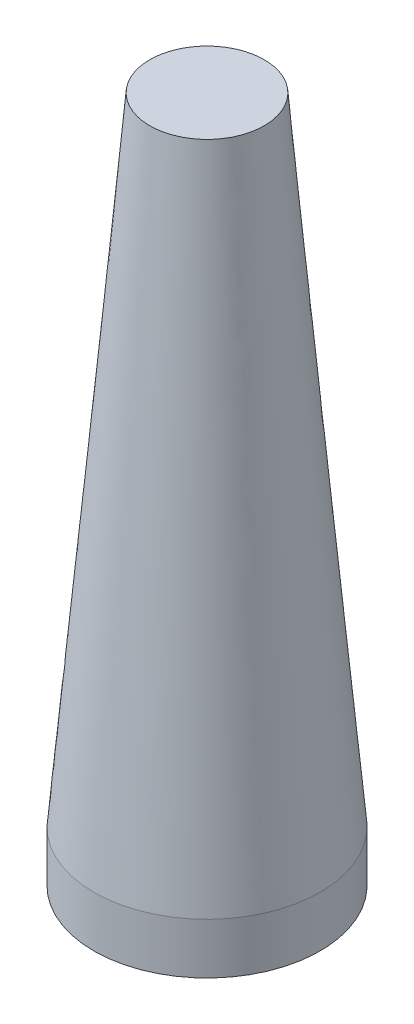
ISO-10303-21;
HEADER;
FILE_DESCRIPTION(('STEP AP214'),'2;1');
FILE_NAME('part.step','',(''),(''),'','','');
FILE_SCHEMA(('AUTOMOTIVE_DESIGN { 1 0 10303 214 1 1 1 1 }'));
ENDSEC;
DATA;
#1=APPLICATION_CONTEXT('core data for automotive mechanical design processes');
#2=APPLICATION_PROTOCOL_DEFINITION('international standard','automotive_design',2000,#1);
#3=PRODUCT_CONTEXT('',#1,'mechanical');
#4=PRODUCT('Part','Part','',(#3));
#5=PRODUCT_RELATED_PRODUCT_CATEGORY('part','',(#4));
#6=PRODUCT_DEFINITION_FORMATION('','',#4);
#7=PRODUCT_DEFINITION_CONTEXT('part definition',#1,'design');
#8=PRODUCT_DEFINITION('design','',#6,#7);
#9=PRODUCT_DEFINITION_SHAPE('','',#8);
#10=(LENGTH_UNIT() NAMED_UNIT(*) SI_UNIT(.MILLI.,.METRE.));
#11=(NAMED_UNIT(*) PLANE_ANGLE_UNIT() SI_UNIT($,.RADIAN.));
#12=(NAMED_UNIT(*) SI_UNIT($,.STERADIAN.) SOLID_ANGLE_UNIT());
#13=UNCERTAINTY_MEASURE_WITH_UNIT(LENGTH_MEASURE(1.E-05),#10,'distance_accuracy_value','');
#14=(GEOMETRIC_REPRESENTATION_CONTEXT(3) GLOBAL_UNCERTAINTY_ASSIGNED_CONTEXT((#13)) GLOBAL_UNIT_ASSIGNED_CONTEXT((#10,
#11,#12)) REPRESENTATION_CONTEXT('',''));
#15=CARTESIAN_POINT('',(0.,0.,0.));
#16=DIRECTION('',(0.,0.,1.));
#17=DIRECTION('',(1.,0.,0.));
#18=AXIS2_PLACEMENT_3D('',#15,#16,#17);
#19=CARTESIAN_POINT('',(0.,115.,0.));
#20=DIRECTION('',(0.,-1.,0.));
#21=DIRECTION('',(0.,0.,-1.));
#22=AXIS2_PLACEMENT_3D('',#19,#20,#21);
#23=PLANE('',#22);
#24=CARTESIAN_POINT('',(0.,115.,0.));
#25=DIRECTION('',(0.,-1.,0.));
#26=DIRECTION('',(0.,0.,-1.));
#27=AXIS2_PLACEMENT_3D('',#24,#25,#26);
#28=CIRCLE('',#27,5.);
#29=CARTESIAN_POINT('',(4.26811767811483,115.,-2.60445224294162));
#30=VERTEX_POINT('',#29);
#31=EDGE_CURVE('E59',#30,#30,#28,.T.);
#32=ORIENTED_EDGE('',*,*,#31,.T.);
#33=EDGE_LOOP('',(#32));
#34=FACE_BOUND('',#33,.T.);
#35=ADVANCED_FACE('F47',(#34),#23,.T.);
#36=CARTESIAN_POINT('',(4.26811767811483,115.,-2.60445224294162));
#37=CARTESIAN_POINT('',(13.6349834115237,0.,-1.77474712775499));
#38=CARTESIAN_POINT('',(9.47702216399808,115.,5.93178311328804));
#39=CARTESIAN_POINT('',(17.1844776670336,0.,25.4952196952923));
#40=CARTESIAN_POINT('',(0.940786807768411,115.,11.1406875991713));
#41=CARTESIAN_POINT('',(-10.0854891560137,0.,29.0447139508023));
#42=CARTESIAN_POINT('',(-4.26811767811483,115.,2.60445224294162));
#43=CARTESIAN_POINT('',(-13.6349834115237,0.,1.774747127755));
#44=CARTESIAN_POINT('',(-9.47702216399808,115.,-5.93178311328804));
#45=CARTESIAN_POINT('',(-17.1844776670337,0.,-25.4952196952923));
#46=CARTESIAN_POINT('',(-0.940786807768409,115.,-11.1406875991713));
#47=CARTESIAN_POINT('',(10.0854891560137,0.,-29.0447139508023));
#48=CARTESIAN_POINT('',(4.26811767811483,115.,-2.60445224294162));
#49=CARTESIAN_POINT('',(13.6349834115237,0.,-1.77474712775499));
#50=(BOUNDED_SURFACE() B_SPLINE_SURFACE(3,1,((#36,#37),(#38,#39),(#40,#41),(#42,#43),(#44,#45),
(#46,#47),(#48,#49)),.UNSPECIFIED.,.T.,.F.,.F.) B_SPLINE_SURFACE_WITH_KNOTS((4,3,4),(2,2),(0.,
0.5,1.),(0.,1.),.UNSPECIFIED.) GEOMETRIC_REPRESENTATION_ITEM() RATIONAL_B_SPLINE_SURFACE(((1.,
1.),(0.333333333333333,0.333333333333333),(0.333333333333333,0.333333333333333),(1.,1.),
(0.333333333333333,0.333333333333333),(0.333333333333333,0.333333333333333),(1.,1.))) REPRESENTATION_ITEM('') SURFACE());
#51=CARTESIAN_POINT('',(0.,0.,0.));
#52=DIRECTION('',(0.,-1.,0.));
#53=DIRECTION('',(0.,0.,-1.));
#54=AXIS2_PLACEMENT_3D('',#51,#52,#53);
#55=CIRCLE('',#54,13.75);
#56=CARTESIAN_POINT('',(13.6349834115237,0.,-1.77474712775499));
#57=VERTEX_POINT('',#56);
#58=EDGE_CURVE('E145',#57,#57,#55,.T.);
#59=CARTESIAN_POINT('',(4.26811767811483,115.,-2.60445224294162));
#60=CARTESIAN_POINT('',(4.36568919617118,113.802083333333,-2.59580948132509));
#61=CARTESIAN_POINT('',(4.46326071422752,112.604166666667,-2.58716671970857));
#62=CARTESIAN_POINT('',(4.6584037503402,110.208333333333,-2.56988119647551));
#63=CARTESIAN_POINT('',(4.75597526839654,109.010416666667,-2.56123843485899));
#64=CARTESIAN_POINT('',(4.95111830450923,106.614583333333,-2.54395291162593));
#65=CARTESIAN_POINT('',(5.04868982256557,105.416666666667,-2.5353101500094));
#66=CARTESIAN_POINT('',(5.24383285867825,103.020833333333,-2.51802462677635));
#67=CARTESIAN_POINT('',(5.3414043767346,101.822916666667,-2.50938186515982));
#68=CARTESIAN_POINT('',(5.53654741284728,99.4270833333333,-2.49209634192677));
#69=CARTESIAN_POINT('',(5.63411893090362,98.2291666666667,-2.48345358031024));
#70=CARTESIAN_POINT('',(5.8292619670163,95.8333333333333,-2.46616805707718));
#71=CARTESIAN_POINT('',(5.92683348507265,94.6354166666667,-2.45752529546066));
#72=CARTESIAN_POINT('',(6.12197652118533,92.2395833333333,-2.4402397722276));
#73=CARTESIAN_POINT('',(6.21954803924167,91.0416666666667,-2.43159701061107));
#74=CARTESIAN_POINT('',(6.41469107535436,88.6458333333333,-2.41431148737802));
#75=CARTESIAN_POINT('',(6.5122625934107,87.4479166666667,-2.40566872576149));
#76=CARTESIAN_POINT('',(6.70740562952338,85.0520833333333,-2.38838320252844));
#77=CARTESIAN_POINT('',(6.80497714757972,83.8541666666667,-2.37974044091191));
#78=CARTESIAN_POINT('',(7.00012018369241,81.4583333333333,-2.36245491767886));
#79=CARTESIAN_POINT('',(7.09769170174875,80.2604166666667,-2.35381215606233));
#80=CARTESIAN_POINT('',(7.29283473786143,77.8645833333333,-2.33652663282927));
#81=CARTESIAN_POINT('',(7.39040625591778,76.6666666666667,-2.32788387121275));
#82=CARTESIAN_POINT('',(7.58554929203046,74.2708333333333,-2.31059834797969));
#83=CARTESIAN_POINT('',(7.6831208100868,73.0729166666667,-2.30195558636316));
#84=CARTESIAN_POINT('',(7.87826384619949,70.6770833333333,-2.28467006313011));
#85=CARTESIAN_POINT('',(7.97583536425583,69.4791666666667,-2.27602730151358));
#86=CARTESIAN_POINT('',(8.17097840036851,67.0833333333333,-2.25874177828053));
#87=CARTESIAN_POINT('',(8.26854991842485,65.8854166666667,-2.250099016664));
#88=CARTESIAN_POINT('',(8.46369295453754,63.4895833333333,-2.23281349343094));
#89=CARTESIAN_POINT('',(8.56126447259388,62.2916666666667,-2.22417073181442));
#90=CARTESIAN_POINT('',(8.75640750870656,59.8958333333333,-2.20688520858136));
#91=CARTESIAN_POINT('',(8.85397902676291,58.6979166666667,-2.19824244696483));
#92=CARTESIAN_POINT('',(9.04912206287559,56.3020833333333,-2.18095692373178));
#93=CARTESIAN_POINT('',(9.14669358093193,55.1041666666667,-2.17231416211525));
#94=CARTESIAN_POINT('',(9.34183661704462,52.7083333333333,-2.1550286388822));
#95=CARTESIAN_POINT('',(9.43940813510096,51.5104166666667,-2.14638587726567));
#96=CARTESIAN_POINT('',(9.63455117121364,49.1145833333333,-2.12910035403262));
#97=CARTESIAN_POINT('',(9.73212268926998,47.9166666666667,-2.12045759241609));
#98=CARTESIAN_POINT('',(9.92726572538267,45.5208333333333,-2.10317206918303));
#99=CARTESIAN_POINT('',(10.024837243439,44.3229166666667,-2.09452930756651));
#100=CARTESIAN_POINT('',(10.2199802795517,41.9270833333333,-2.07724378433345));
#101=CARTESIAN_POINT('',(10.317551797608,40.7291666666667,-2.06860102271692));
#102=CARTESIAN_POINT('',(10.5126948337207,38.3333333333333,-2.05131549948387));
#103=CARTESIAN_POINT('',(10.6102663517771,37.1354166666667,-2.04267273786734));
#104=CARTESIAN_POINT('',(10.8054093878897,34.7395833333333,-2.02538721463429));
#105=CARTESIAN_POINT('',(10.9029809059461,33.5416666666667,-2.01674445301776));
#106=CARTESIAN_POINT('',(11.0981239420588,31.1458333333333,-1.9994589297847));
#107=CARTESIAN_POINT('',(11.1956954601151,29.9479166666667,-1.99081616816818));
#108=CARTESIAN_POINT('',(11.3908384962278,27.5520833333333,-1.97353064493512));
#109=CARTESIAN_POINT('',(11.4884100142841,26.3541666666667,-1.96488788331859));
#110=CARTESIAN_POINT('',(11.6835530503968,23.9583333333333,-1.94760236008554));
#111=CARTESIAN_POINT('',(11.7811245684532,22.7604166666667,-1.93895959846901));
#112=CARTESIAN_POINT('',(11.9762676045658,20.3645833333333,-1.92167407523596));
#113=CARTESIAN_POINT('',(12.0738391226222,19.1666666666667,-1.91303131361943));
#114=CARTESIAN_POINT('',(12.2689821587349,16.7708333333333,-1.89574579038638));
#115=CARTESIAN_POINT('',(12.3665536767912,15.5729166666667,-1.88710302876985));
#116=CARTESIAN_POINT('',(12.5616967129039,13.1770833333333,-1.86981750553679));
#117=CARTESIAN_POINT('',(12.6592682309602,11.9791666666667,-1.86117474392027));
#118=CARTESIAN_POINT('',(12.8544112670729,9.58333333333333,-1.84388922068721));
#119=CARTESIAN_POINT('',(12.9519827851293,8.38541666666667,-1.83524645907068));
#120=CARTESIAN_POINT('',(13.1471258212419,5.98958333333333,-1.81796093583763));
#121=CARTESIAN_POINT('',(13.2446973392983,4.79166666666667,-1.8093181742211));
#122=CARTESIAN_POINT('',(13.439840375411,2.39583333333333,-1.79203265098805));
#123=CARTESIAN_POINT('',(13.5374118934673,1.19791666666667,-1.78338988937152));
#124=CARTESIAN_POINT('',(13.6349834115237,0.,-1.77474712775499));
#125=B_SPLINE_CURVE_WITH_KNOTS('',3,(#59,#60,#61,#62,#63,#64,#65,#66,#67,#68,#69,#70,#71,#72,
#73,#74,#75,#76,#77,#78,#79,#80,#81,#82,#83,#84,#85,#86,#87,#88,#89,#90,#91,#92,#93,#94,#95,#96,
#97,#98,#99,#100,#101,#102,#103,#104,#105,#106,#107,#108,#109,#110,#111,#112,#113,#114,#115,
#116,#117,#118,#119,#120,#121,#122,#123,#124),.UNSPECIFIED.,.F.,.F.,(4,2,2,2,2,2,2,2,2,2,2,2,2,
2,2,2,2,2,2,2,2,2,2,2,2,2,2,2,2,2,2,2,4),(0.,3.60574446524954,7.21148893049906,10.8172333957486,
14.4229778609981,18.0287223262476,21.6344667914972,25.2402112567467,28.8459557219962,
32.4517001872458,36.0574446524953,39.6631891177448,43.2689335829943,46.8746780482439,
50.4804225134934,54.0861669787429,57.6919114439925,61.297655909242,64.9034003744915,
68.509144839741,72.1148893049906,75.7206337702401,79.3263782354896,82.9321227007391,
86.5378671659887,90.1436116312382,93.7493560964877,97.3551005617373,100.960845026987,
104.566589492236,108.172333957486,111.778078422735,115.383822887985),.UNSPECIFIED.);
#126=EDGE_CURVE('BSEAM101',#30,#57,#125,.T.);
#127=ORIENTED_EDGE('',*,*,#31,.F.);
#128=ORIENTED_EDGE('',*,*,#58,.T.);
#129=ORIENTED_EDGE('',*,*,#126,.T.);
#130=ORIENTED_EDGE('',*,*,#126,.F.);
#131=EDGE_LOOP('',(#127,#129,#128,#130));
#132=FACE_BOUND('',#131,.T.);
#133=ADVANCED_FACE('F101',(#132),#50,.F.);
#134=CARTESIAN_POINT('',(0.,-10.,0.));
#135=DIRECTION('',(0.,-1.,0.));
#136=DIRECTION('',(0.,0.,-1.));
#137=AXIS2_PLACEMENT_3D('',#134,#135,#136);
#138=PLANE('',#137);
#139=CARTESIAN_POINT('',(0.,-10.,0.));
#140=DIRECTION('',(0.,-1.,0.));
#141=DIRECTION('',(0.,0.,-1.));
#142=AXIS2_PLACEMENT_3D('',#139,#140,#141);
#143=CIRCLE('',#142,22.25);
#144=CARTESIAN_POINT('',(0.,-10.,-22.25));
#145=VERTEX_POINT('',#144);
#146=EDGE_CURVE('E68',#145,#145,#143,.T.);
#147=ORIENTED_EDGE('',*,*,#146,.T.);
#148=EDGE_LOOP('',(#147));
#149=FACE_BOUND('',#148,.T.);
#150=CARTESIAN_POINT('',(0.,-10.,0.));
#151=DIRECTION('',(0.,-1.,0.));
#152=DIRECTION('',(0.,0.,-1.));
#153=AXIS2_PLACEMENT_3D('',#150,#151,#152);
#154=CIRCLE('',#153,13.75);
#155=CARTESIAN_POINT('',(0.,-10.,-13.75));
#156=VERTEX_POINT('',#155);
#157=EDGE_CURVE('E138',#156,#156,#154,.T.);
#158=ORIENTED_EDGE('',*,*,#157,.F.);
#159=EDGE_LOOP('',(#158));
#160=FACE_BOUND('',#159,.T.);
#161=ADVANCED_FACE('F95',(#149,#160),#138,.T.);
#162=CARTESIAN_POINT('',(0.,-10.,0.));
#163=DIRECTION('',(0.,1.,0.));
#164=DIRECTION('',(0.,0.,1.));
#165=AXIS2_PLACEMENT_3D('',#162,#163,#164);
#166=CYLINDRICAL_SURFACE('',#165,22.25);
#167=ORIENTED_EDGE('',*,*,#146,.F.);
#168=EDGE_LOOP('',(#167));
#169=FACE_BOUND('',#168,.T.);
#170=CARTESIAN_POINT('',(0.,0.,0.));
#171=DIRECTION('',(0.,-1.,0.));
#172=DIRECTION('',(0.,0.,-1.));
#173=AXIS2_PLACEMENT_3D('',#170,#171,#172);
#174=CIRCLE('',#173,22.25);
#175=CARTESIAN_POINT('',(-11.9811061483932,0.,18.7487491705696));
#176=VERTEX_POINT('',#175);
#177=EDGE_CURVE('E80',#176,#176,#174,.T.);
#178=ORIENTED_EDGE('',*,*,#177,.T.);
#179=EDGE_LOOP('',(#178));
#180=FACE_BOUND('',#179,.T.);
#181=ADVANCED_FACE('F84',(#169,#180),#166,.T.);
#182=CARTESIAN_POINT('',(0.,-10.,0.));
#183=DIRECTION('',(0.,1.,0.));
#184=DIRECTION('',(0.,0.,1.));
#185=AXIS2_PLACEMENT_3D('',#182,#183,#184);
#186=CYLINDRICAL_SURFACE('',#185,13.75);
#187=ORIENTED_EDGE('',*,*,#157,.T.);
#188=EDGE_LOOP('',(#187));
#189=FACE_BOUND('',#188,.T.);
#190=ORIENTED_EDGE('',*,*,#58,.F.);
#191=EDGE_LOOP('',(#190));
#192=FACE_BOUND('',#191,.T.);
#193=ADVANCED_FACE('F94',(#189,#192),#186,.F.);
#194=CARTESIAN_POINT('',(0.,124.999999936,0.));
#195=DIRECTION('',(0.,1.,0.));
#196=DIRECTION('',(0.,0.,1.));
#197=AXIS2_PLACEMENT_3D('',#194,#195,#196);
#198=PLANE('',#197);
#199=CARTESIAN_POINT('',(0.,124.999999936,0.));
#200=DIRECTION('',(0.,1.,0.));
#201=DIRECTION('',(0.,0.,1.));
#202=AXIS2_PLACEMENT_3D('',#199,#200,#201);
#203=CIRCLE('',#202,11.25);
#204=CARTESIAN_POINT('',(-7.68568294276128,124.999999936,8.21539881584262));
#205=VERTEX_POINT('',#204);
#206=EDGE_CURVE('E11',#205,#205,#203,.T.);
#207=ORIENTED_EDGE('',*,*,#206,.T.);
#208=EDGE_LOOP('',(#207));
#209=FACE_BOUND('',#208,.T.);
#210=ADVANCED_FACE('F168',(#209),#198,.T.);
#211=CARTESIAN_POINT('',(-7.68568294276128,124.999999936,8.21539881584262));
#212=CARTESIAN_POINT('',(-11.9811061483932,0.,18.7487491705696));
#213=CARTESIAN_POINT('',(-24.1164805744465,124.999999936,-7.15596706967995));
#214=CARTESIAN_POINT('',(-49.4786044895324,0.,-5.21346312621669));
#215=CARTESIAN_POINT('',(-8.74511468892395,124.999999936,-23.5867647013652));
#216=CARTESIAN_POINT('',(-25.5163921927461,0.,-42.710961467356));
#217=CARTESIAN_POINT('',(7.68568294276128,124.999999936,-8.21539881584262));
#218=CARTESIAN_POINT('',(11.9811061483932,0.,-18.7487491705696));
#219=CARTESIAN_POINT('',(24.1164805744465,124.999999936,7.15596706967995));
#220=CARTESIAN_POINT('',(49.4786044895325,0.,5.21346312621671));
#221=CARTESIAN_POINT('',(8.74511468892395,124.999999936,23.5867647013652));
#222=CARTESIAN_POINT('',(25.5163921927461,0.,42.710961467356));
#223=CARTESIAN_POINT('',(-7.68568294276128,124.999999936,8.21539881584262));
#224=CARTESIAN_POINT('',(-11.9811061483932,0.,18.7487491705696));
#225=(BOUNDED_SURFACE() B_SPLINE_SURFACE(3,1,((#211,#212),(#213,#214),(#215,#216),(#217,#218),
(#219,#220),(#221,#222),(#223,#224)),.UNSPECIFIED.,.T.,.F.,.F.) B_SPLINE_SURFACE_WITH_KNOTS((4,
3,4),(2,2),(0.,0.5,1.),(0.,1.),
.UNSPECIFIED.) GEOMETRIC_REPRESENTATION_ITEM() RATIONAL_B_SPLINE_SURFACE(((1.,1.),
(0.333333333333333,0.333333333333333),(0.333333333333333,0.333333333333333),(1.,1.),
(0.333333333333333,0.333333333333333),(0.333333333333333,0.333333333333333),(1.,1.))) REPRESENTATION_ITEM('') SURFACE());
#226=CARTESIAN_POINT('',(-7.68568294276128,124.999999936,8.21539881584262));
#227=CARTESIAN_POINT('',(-7.73042693448662,123.697916603333,8.32512121537103));
#228=CARTESIAN_POINT('',(-7.77517092621195,122.395833270667,8.43484361489943));
#229=CARTESIAN_POINT('',(-7.86465890966261,119.791666605333,8.65428841395624));
#230=CARTESIAN_POINT('',(-7.90940290138794,118.489583272667,8.76401081348465));
#231=CARTESIAN_POINT('',(-7.99889088483861,115.885416607333,8.98345561254146));
#232=CARTESIAN_POINT('',(-8.04363487656394,114.583333274667,9.09317801206987));
#233=CARTESIAN_POINT('',(-8.1331228600146,111.979166609333,9.31262281112668));
#234=CARTESIAN_POINT('',(-8.17786685173994,110.677083276667,9.42234521065509));
#235=CARTESIAN_POINT('',(-8.2673548351906,108.072916611333,9.6417900097119));
#236=CARTESIAN_POINT('',(-8.31209882691593,106.770833278667,9.75151240924031));
#237=CARTESIAN_POINT('',(-8.4015868103666,104.166666613333,9.97095720829712));
#238=CARTESIAN_POINT('',(-8.44633080209193,102.864583280667,10.0806796078255));
#239=CARTESIAN_POINT('',(-8.53581878554259,100.260416615333,10.3001244068823));
#240=CARTESIAN_POINT('',(-8.58056277726793,98.9583332826667,10.4098468064107));
#241=CARTESIAN_POINT('',(-8.67005076071859,96.3541666173333,10.6292916054676));
#242=CARTESIAN_POINT('',(-8.71479475244392,95.0520832846667,10.739014004996));
#243=CARTESIAN_POINT('',(-8.80428273589458,92.4479166193333,10.9584588040528));
#244=CARTESIAN_POINT('',(-8.84902672761992,91.1458332866667,11.0681812035812));
#245=CARTESIAN_POINT('',(-8.93851471107058,88.5416666213333,11.287626002638));
#246=CARTESIAN_POINT('',(-8.98325870279591,87.2395832886667,11.3973484021664));
#247=CARTESIAN_POINT('',(-9.07274668624658,84.6354166233333,11.6167932012232));
#248=CARTESIAN_POINT('',(-9.11749067797191,83.3333332906667,11.7265156007516));
#249=CARTESIAN_POINT('',(-9.20697866142257,80.7291666253333,11.9459603998084));
#250=CARTESIAN_POINT('',(-9.25172265314791,79.4270832926667,12.0556827993368));
#251=CARTESIAN_POINT('',(-9.34121063659857,76.8229166273333,12.2751275983937));
#252=CARTESIAN_POINT('',(-9.3859546283239,75.5208332946667,12.3848499979221));
#253=CARTESIAN_POINT('',(-9.47544261177457,72.9166666293333,12.6042947969789));
#254=CARTESIAN_POINT('',(-9.5201866034999,71.6145832966667,12.7140171965073));
#255=CARTESIAN_POINT('',(-9.60967458695056,69.0104166313333,12.9334619955641));
#256=CARTESIAN_POINT('',(-9.65441857867589,67.7083332986667,13.0431843950925));
#257=CARTESIAN_POINT('',(-9.74390656212656,65.1041666333333,13.2626291941493));
#258=CARTESIAN_POINT('',(-9.78865055385189,63.8020833006667,13.3723515936777));
#259=CARTESIAN_POINT('',(-9.87813853730255,61.1979166353333,13.5917963927345));
#260=CARTESIAN_POINT('',(-9.92288252902789,59.8958333026667,13.7015187922629));
#261=CARTESIAN_POINT('',(-10.0123705124786,57.2916666373333,13.9209635913198));
#262=CARTESIAN_POINT('',(-10.0571145042039,55.9895833046667,14.0306859908482));
#263=CARTESIAN_POINT('',(-10.1466024876545,53.3854166393333,14.250130789905));
#264=CARTESIAN_POINT('',(-10.1913464793799,52.0833333066667,14.3598531894334));
#265=CARTESIAN_POINT('',(-10.2808344628305,49.4791666413333,14.5792979884902));
#266=CARTESIAN_POINT('',(-10.3255784545559,48.1770833086667,14.6890203880186));
#267=CARTESIAN_POINT('',(-10.4150664380065,45.5729166433333,14.9084651870754));
#268=CARTESIAN_POINT('',(-10.4598104297319,44.2708333106667,15.0181875866038));
#269=CARTESIAN_POINT('',(-10.5492984131825,41.6666666453333,15.2376323856606));
#270=CARTESIAN_POINT('',(-10.5940424049079,40.3645833126667,15.347354785189));
#271=CARTESIAN_POINT('',(-10.6835303883585,37.7604166473333,15.5667995842458));
#272=CARTESIAN_POINT('',(-10.7282743800839,36.4583333146667,15.6765219837743));
#273=CARTESIAN_POINT('',(-10.8177623635345,33.8541666493333,15.8959667828311));
#274=CARTESIAN_POINT('',(-10.8625063552599,32.5520833166667,16.0056891823595));
#275=CARTESIAN_POINT('',(-10.9519943387105,29.9479166513333,16.2251339814163));
#276=CARTESIAN_POINT('',(-10.9967383304359,28.6458333186667,16.3348563809447));
#277=CARTESIAN_POINT('',(-11.0862263138865,26.0416666533333,16.5543011800015));
#278=CARTESIAN_POINT('',(-11.1309703056119,24.7395833206667,16.6640235795299));
#279=CARTESIAN_POINT('',(-11.2204582890625,22.1354166553333,16.8834683785867));
#280=CARTESIAN_POINT('',(-11.2652022807879,20.8333333226667,16.9931907781151));
#281=CARTESIAN_POINT('',(-11.3546902642385,18.2291666573333,17.2126355771719));
#282=CARTESIAN_POINT('',(-11.3994342559638,16.9270833246667,17.3223579767004));
#283=CARTESIAN_POINT('',(-11.4889222394145,14.3229166593333,17.5418027757572));
#284=CARTESIAN_POINT('',(-11.5336662311398,13.0208333266667,17.6515251752856));
#285=CARTESIAN_POINT('',(-11.6231542145905,10.4166666613333,17.8709699743424));
#286=CARTESIAN_POINT('',(-11.6678982063158,9.11458332866667,17.9806923738708));
#287=CARTESIAN_POINT('',(-11.7573861897665,6.51041666333333,18.2001371729276));
#288=CARTESIAN_POINT('',(-11.8021301814918,5.20833333066667,18.309859572456));
#289=CARTESIAN_POINT('',(-11.8916181649425,2.60416666533333,18.5293043715128));
#290=CARTESIAN_POINT('',(-11.9363621566678,1.30208333266667,18.6390267710412));
#291=CARTESIAN_POINT('',(-11.9811061483932,0.,18.7487491705696));
#292=B_SPLINE_CURVE_WITH_KNOTS('',3,(#226,#227,#228,#229,#230,#231,#232,#233,#234,#235,#236,
#237,#238,#239,#240,#241,#242,#243,#244,#245,#246,#247,#248,#249,#250,#251,#252,#253,#254,#255,
#256,#257,#258,#259,#260,#261,#262,#263,#264,#265,#266,#267,#268,#269,#270,#271,#272,#273,#274,
#275,#276,#277,#278,#279,#280,#281,#282,#283,#284,#285,#286,#287,#288,#289,#290,#291),
.UNSPECIFIED.,.F.,.F.,(4,2,2,2,2,2,2,2,2,2,2,2,2,2,2,2,2,2,2,2,2,2,2,2,2,2,2,2,2,2,2,2,4),(0.,
3.92239191242526,7.84478382485053,11.7671757372758,15.689567649701,19.6119595621263,
23.5343514745516,27.4567433869768,31.3791352994021,35.3015272118273,39.2239191242526,
43.1463110366779,47.0687029491031,50.9910948615284,54.9134867739537,58.8358786863789,
62.7582705988042,66.6806625112294,70.6030544236547,74.52544633608,78.4478382485052,
82.3702301609305,86.2926220733557,90.215013985781,94.1374058982062,98.0597978106315,
101.982189723057,105.904581635482,109.826973547907,113.749365460333,117.671757372758,
121.594149285183,125.516541197608),.UNSPECIFIED.);
#293=EDGE_CURVE('BSEAM49',#205,#176,#292,.T.);
#294=ORIENTED_EDGE('',*,*,#206,.F.);
#295=ORIENTED_EDGE('',*,*,#177,.F.);
#296=ORIENTED_EDGE('',*,*,#293,.T.);
#297=ORIENTED_EDGE('',*,*,#293,.F.);
#298=EDGE_LOOP('',(#294,#296,#295,#297));
#299=FACE_BOUND('',#298,.T.);
#300=ADVANCED_FACE('F49',(#299),#225,.T.);
#301=CLOSED_SHELL('',(#35,#133,#161,#181,#193,#210,#300));
#302=MANIFOLD_SOLID_BREP('B2',#301);
#303=ADVANCED_BREP_SHAPE_REPRESENTATION('',(#18,#302),#14);
#304=SHAPE_DEFINITION_REPRESENTATION(#9,#303);
ENDSEC;
END-ISO-10303-21;
